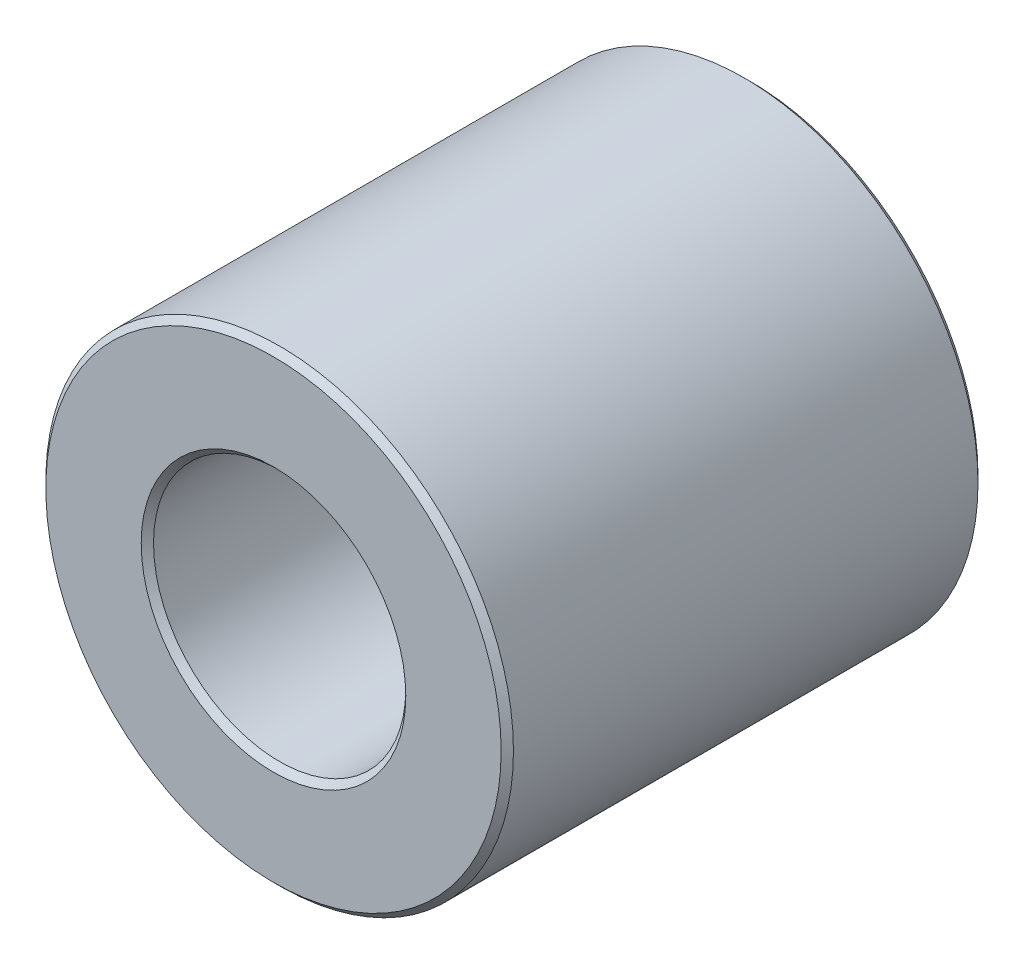
ISO-10303-21;
HEADER;
FILE_DESCRIPTION(('STEP AP214'),'2;1');
FILE_NAME('part.step','',(''),(''),'','','');
FILE_SCHEMA(('AUTOMOTIVE_DESIGN { 1 0 10303 214 1 1 1 1 }'));
ENDSEC;
DATA;
#1=APPLICATION_CONTEXT('core data for automotive mechanical design processes');
#2=APPLICATION_PROTOCOL_DEFINITION('international standard','automotive_design',2000,#1);
#3=PRODUCT_CONTEXT('',#1,'mechanical');
#4=PRODUCT('Part','Part','',(#3));
#5=PRODUCT_RELATED_PRODUCT_CATEGORY('part','',(#4));
#6=PRODUCT_DEFINITION_FORMATION('','',#4);
#7=PRODUCT_DEFINITION_CONTEXT('part definition',#1,'design');
#8=PRODUCT_DEFINITION('design','',#6,#7);
#9=PRODUCT_DEFINITION_SHAPE('','',#8);
#10=(LENGTH_UNIT() NAMED_UNIT(*) SI_UNIT(.MILLI.,.METRE.));
#11=(NAMED_UNIT(*) PLANE_ANGLE_UNIT() SI_UNIT($,.RADIAN.));
#12=(NAMED_UNIT(*) SI_UNIT($,.STERADIAN.) SOLID_ANGLE_UNIT());
#13=UNCERTAINTY_MEASURE_WITH_UNIT(LENGTH_MEASURE(1.E-05),#10,'distance_accuracy_value','');
#14=(GEOMETRIC_REPRESENTATION_CONTEXT(3) GLOBAL_UNCERTAINTY_ASSIGNED_CONTEXT((#13)) GLOBAL_UNIT_ASSIGNED_CONTEXT((#10,
#11,#12)) REPRESENTATION_CONTEXT('',''));
#15=CARTESIAN_POINT('',(0.,0.,0.));
#16=DIRECTION('',(0.,0.,1.));
#17=DIRECTION('',(1.,0.,0.));
#18=AXIS2_PLACEMENT_3D('',#15,#16,#17);
#19=CARTESIAN_POINT('',(0.,0.,15.5));
#20=DIRECTION('',(0.,0.,1.));
#21=DIRECTION('',(1.,0.,0.));
#22=AXIS2_PLACEMENT_3D('',#19,#20,#21);
#23=PLANE('',#22);
#24=CARTESIAN_POINT('',(0.,0.,15.5));
#25=DIRECTION('',(0.,0.,1.));
#26=DIRECTION('',(1.,0.,0.));
#27=AXIS2_PLACEMENT_3D('',#24,#25,#26);
#28=CIRCLE('',#27,4.3);
#29=CARTESIAN_POINT('',(4.3,0.,15.5));
#30=VERTEX_POINT('',#29);
#31=EDGE_CURVE('E43',#30,#30,#28,.F.);
#32=ORIENTED_EDGE('',*,*,#31,.T.);
#33=EDGE_LOOP('',(#32));
#34=FACE_BOUND('',#33,.T.);
#35=CARTESIAN_POINT('',(0.,0.,15.5));
#36=DIRECTION('',(0.,0.,1.));
#37=DIRECTION('',(1.,0.,0.));
#38=AXIS2_PLACEMENT_3D('',#35,#36,#37);
#39=CIRCLE('',#38,7.40000000000001);
#40=CARTESIAN_POINT('',(7.40000000000001,0.,15.5));
#41=VERTEX_POINT('',#40);
#42=EDGE_CURVE('E47',#41,#41,#39,.T.);
#43=ORIENTED_EDGE('',*,*,#42,.T.);
#44=EDGE_LOOP('',(#43));
#45=FACE_BOUND('',#44,.T.);
#46=ADVANCED_FACE('F32',(#34,#45),#23,.T.);
#47=CARTESIAN_POINT('',(0.,0.,0.));
#48=DIRECTION('',(0.,0.,1.));
#49=DIRECTION('',(1.,0.,0.));
#50=AXIS2_PLACEMENT_3D('',#47,#48,#49);
#51=PLANE('',#50);
#52=CARTESIAN_POINT('',(0.,0.,0.));
#53=DIRECTION('',(0.,0.,1.));
#54=DIRECTION('',(1.,0.,0.));
#55=AXIS2_PLACEMENT_3D('',#52,#53,#54);
#56=CIRCLE('',#55,4.3);
#57=CARTESIAN_POINT('',(4.3,0.,0.));
#58=VERTEX_POINT('',#57);
#59=EDGE_CURVE('E58',#58,#58,#56,.T.);
#60=ORIENTED_EDGE('',*,*,#59,.T.);
#61=EDGE_LOOP('',(#60));
#62=FACE_BOUND('',#61,.T.);
#63=CARTESIAN_POINT('',(0.,0.,0.));
#64=DIRECTION('',(0.,0.,1.));
#65=DIRECTION('',(1.,0.,0.));
#66=AXIS2_PLACEMENT_3D('',#63,#64,#65);
#67=CIRCLE('',#66,7.4);
#68=CARTESIAN_POINT('',(7.4,0.,0.));
#69=VERTEX_POINT('',#68);
#70=EDGE_CURVE('E61',#69,#69,#67,.F.);
#71=ORIENTED_EDGE('',*,*,#70,.T.);
#72=EDGE_LOOP('',(#71));
#73=FACE_BOUND('',#72,.T.);
#74=ADVANCED_FACE('F65',(#62,#73),#51,.F.);
#75=CARTESIAN_POINT('',(0.,0.,15.5));
#76=DIRECTION('',(0.,0.,-1.));
#77=DIRECTION('',(-1.,0.,0.));
#78=AXIS2_PLACEMENT_3D('',#75,#76,#77);
#79=CYLINDRICAL_SURFACE('',#78,7.6);
#80=CARTESIAN_POINT('',(0.,0.,0.200000000000002));
#81=DIRECTION('',(0.,0.,1.));
#82=DIRECTION('',(1.,0.,0.));
#83=AXIS2_PLACEMENT_3D('',#80,#81,#82);
#84=CIRCLE('',#83,7.6);
#85=CARTESIAN_POINT('',(7.6,0.,0.200000000000002));
#86=VERTEX_POINT('',#85);
#87=EDGE_CURVE('E10',#86,#86,#84,.T.);
#88=ORIENTED_EDGE('',*,*,#87,.T.);
#89=EDGE_LOOP('',(#88));
#90=FACE_BOUND('',#89,.T.);
#91=CARTESIAN_POINT('',(0.,0.,15.3));
#92=DIRECTION('',(0.,0.,1.));
#93=DIRECTION('',(1.,0.,0.));
#94=AXIS2_PLACEMENT_3D('',#91,#92,#93);
#95=CIRCLE('',#94,7.6);
#96=CARTESIAN_POINT('',(7.6,0.,15.3));
#97=VERTEX_POINT('',#96);
#98=EDGE_CURVE('E39',#97,#97,#95,.F.);
#99=ORIENTED_EDGE('',*,*,#98,.T.);
#100=EDGE_LOOP('',(#99));
#101=FACE_BOUND('',#100,.T.);
#102=ADVANCED_FACE('F85',(#90,#101),#79,.T.);
#103=CARTESIAN_POINT('',(0.,0.,15.5));
#104=DIRECTION('',(0.,0.,-1.));
#105=DIRECTION('',(-1.,0.,0.));
#106=AXIS2_PLACEMENT_3D('',#103,#104,#105);
#107=CYLINDRICAL_SURFACE('',#106,4.1);
#108=CARTESIAN_POINT('',(0.,0.,0.199999999999999));
#109=DIRECTION('',(0.,0.,1.));
#110=DIRECTION('',(1.,0.,0.));
#111=AXIS2_PLACEMENT_3D('',#108,#109,#110);
#112=CIRCLE('',#111,4.1);
#113=CARTESIAN_POINT('',(4.1,0.,0.199999999999999));
#114=VERTEX_POINT('',#113);
#115=EDGE_CURVE('E52',#114,#114,#112,.F.);
#116=ORIENTED_EDGE('',*,*,#115,.T.);
#117=EDGE_LOOP('',(#116));
#118=FACE_BOUND('',#117,.T.);
#119=CARTESIAN_POINT('',(0.,0.,15.3));
#120=DIRECTION('',(0.,0.,1.));
#121=DIRECTION('',(1.,0.,0.));
#122=AXIS2_PLACEMENT_3D('',#119,#120,#121);
#123=CIRCLE('',#122,4.1);
#124=CARTESIAN_POINT('',(4.1,0.,15.3));
#125=VERTEX_POINT('',#124);
#126=EDGE_CURVE('E55',#125,#125,#123,.T.);
#127=ORIENTED_EDGE('',*,*,#126,.T.);
#128=EDGE_LOOP('',(#127));
#129=FACE_BOUND('',#128,.T.);
#130=ADVANCED_FACE('F90',(#118,#129),#107,.F.);
#131=CARTESIAN_POINT('',(0.,0.,0.));
#132=DIRECTION('',(0.,0.,-1.));
#133=DIRECTION('',(-1.,0.,0.));
#134=AXIS2_PLACEMENT_3D('',#131,#132,#133);
#135=CONICAL_SURFACE('',#134,4.3,0.785398163397448);
#136=ORIENTED_EDGE('',*,*,#115,.F.);
#137=EDGE_LOOP('',(#136));
#138=FACE_BOUND('',#137,.T.);
#139=ORIENTED_EDGE('',*,*,#59,.F.);
#140=EDGE_LOOP('',(#139));
#141=FACE_BOUND('',#140,.T.);
#142=ADVANCED_FACE('F76',(#138,#141),#135,.F.);
#143=CARTESIAN_POINT('',(0.,0.,15.3));
#144=DIRECTION('',(0.,0.,1.));
#145=DIRECTION('',(1.,0.,0.));
#146=AXIS2_PLACEMENT_3D('',#143,#144,#145);
#147=CONICAL_SURFACE('',#146,4.1,0.785398163397448);
#148=ORIENTED_EDGE('',*,*,#31,.F.);
#149=EDGE_LOOP('',(#148));
#150=FACE_BOUND('',#149,.T.);
#151=ORIENTED_EDGE('',*,*,#126,.F.);
#152=EDGE_LOOP('',(#151));
#153=FACE_BOUND('',#152,.T.);
#154=ADVANCED_FACE('F70',(#150,#153),#147,.F.);
#155=CARTESIAN_POINT('',(0.,0.,0.200000000000002));
#156=DIRECTION('',(0.,0.,1.));
#157=DIRECTION('',(1.,0.,0.));
#158=AXIS2_PLACEMENT_3D('',#155,#156,#157);
#159=CONICAL_SURFACE('',#158,7.6,0.785398163397448);
#160=ORIENTED_EDGE('',*,*,#70,.F.);
#161=EDGE_LOOP('',(#160));
#162=FACE_BOUND('',#161,.T.);
#163=ORIENTED_EDGE('',*,*,#87,.F.);
#164=EDGE_LOOP('',(#163));
#165=FACE_BOUND('',#164,.T.);
#166=ADVANCED_FACE('F67',(#162,#165),#159,.T.);
#167=CARTESIAN_POINT('',(0.,0.,15.5));
#168=DIRECTION('',(0.,0.,-1.));
#169=DIRECTION('',(-1.,0.,0.));
#170=AXIS2_PLACEMENT_3D('',#167,#168,#169);
#171=CONICAL_SURFACE('',#170,7.40000000000001,0.785398163397444);
#172=ORIENTED_EDGE('',*,*,#98,.F.);
#173=EDGE_LOOP('',(#172));
#174=FACE_BOUND('',#173,.T.);
#175=ORIENTED_EDGE('',*,*,#42,.F.);
#176=EDGE_LOOP('',(#175));
#177=FACE_BOUND('',#176,.T.);
#178=ADVANCED_FACE('F34',(#174,#177),#171,.T.);
#179=CLOSED_SHELL('',(#46,#74,#102,#130,#142,#154,#166,#178));
#180=MANIFOLD_SOLID_BREP('B2',#179);
#181=ADVANCED_BREP_SHAPE_REPRESENTATION('',(#18,#180),#14);
#182=SHAPE_DEFINITION_REPRESENTATION(#9,#181);
ENDSEC;
END-ISO-10303-21;
